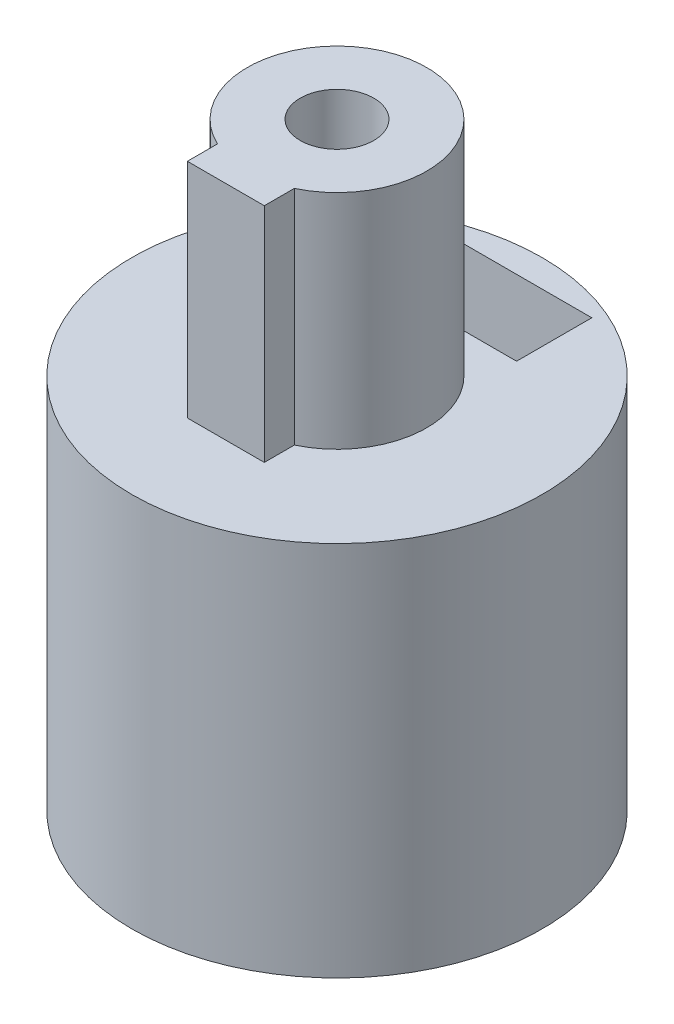
ISO-10303-21;
HEADER;
FILE_DESCRIPTION(('STEP AP214'),'2;1');
FILE_NAME('part.step','',(''),(''),'','','');
FILE_SCHEMA(('AUTOMOTIVE_DESIGN { 1 0 10303 214 1 1 1 1 }'));
ENDSEC;
DATA;
#1=APPLICATION_CONTEXT('core data for automotive mechanical design processes');
#2=APPLICATION_PROTOCOL_DEFINITION('international standard','automotive_design',2000,#1);
#3=PRODUCT_CONTEXT('',#1,'mechanical');
#4=PRODUCT('Part','Part','',(#3));
#5=PRODUCT_RELATED_PRODUCT_CATEGORY('part','',(#4));
#6=PRODUCT_DEFINITION_FORMATION('','',#4);
#7=PRODUCT_DEFINITION_CONTEXT('part definition',#1,'design');
#8=PRODUCT_DEFINITION('design','',#6,#7);
#9=PRODUCT_DEFINITION_SHAPE('','',#8);
#10=(LENGTH_UNIT() NAMED_UNIT(*) SI_UNIT(.MILLI.,.METRE.));
#11=(NAMED_UNIT(*) PLANE_ANGLE_UNIT() SI_UNIT($,.RADIAN.));
#12=(NAMED_UNIT(*) SI_UNIT($,.STERADIAN.) SOLID_ANGLE_UNIT());
#13=UNCERTAINTY_MEASURE_WITH_UNIT(LENGTH_MEASURE(1.E-05),#10,'distance_accuracy_value','');
#14=(GEOMETRIC_REPRESENTATION_CONTEXT(3) GLOBAL_UNCERTAINTY_ASSIGNED_CONTEXT((#13)) GLOBAL_UNIT_ASSIGNED_CONTEXT((#10,
#11,#12)) REPRESENTATION_CONTEXT('',''));
#15=CARTESIAN_POINT('',(0.,0.,0.));
#16=DIRECTION('',(0.,0.,1.));
#17=DIRECTION('',(1.,0.,0.));
#18=AXIS2_PLACEMENT_3D('',#15,#16,#17);
#19=CARTESIAN_POINT('',(0.,7.,-6.));
#20=DIRECTION('',(0.,0.,1.));
#21=DIRECTION('',(1.,0.,0.));
#22=AXIS2_PLACEMENT_3D('',#19,#20,#21);
#23=CYLINDRICAL_SURFACE('',#22,1.025);
#24=CARTESIAN_POINT('',(0.,8.025,-6.));
#25=CARTESIAN_POINT('',(-0.057129021805909,8.02499772840721,-5.99999900775209));
#26=CARTESIAN_POINT('',(-0.114288694426547,8.02020768113553,-5.99917558388442));
#27=CARTESIAN_POINT('',(-0.227003440677618,8.00118285182644,-5.99597008814761));
#28=CARTESIAN_POINT('',(-0.282557014382194,7.98693952098703,-5.99358660551168));
#29=CARTESIAN_POINT('',(-0.390412628331851,7.94945193314389,-5.98752819489086));
#30=CARTESIAN_POINT('',(-0.442717339459975,7.92621518637663,-5.98385434470439));
#31=CARTESIAN_POINT('',(-0.542679246717537,7.87142036283948,-5.97561861890346));
#32=CARTESIAN_POINT('',(-0.590336943676343,7.83986318416035,-5.97105683914425));
#33=CARTESIAN_POINT('',(-0.680135984205956,7.76898696325142,-5.96149941501592));
#34=CARTESIAN_POINT('',(-0.72222399560624,7.7296008182684,-5.95650024504773));
#35=CARTESIAN_POINT('',(-0.799228119899926,7.64432911453603,-5.94665830480908));
#36=CARTESIAN_POINT('',(-0.83414376866182,7.59844313549965,-5.94181554467714));
#37=CARTESIAN_POINT('',(-0.896027332048902,7.50110590633471,-5.93280057753614));
#38=CARTESIAN_POINT('',(-0.922942217268116,7.44962048335678,-5.92863292447034));
#39=CARTESIAN_POINT('',(-0.967721056978088,7.34277612409713,-5.92148911657744));
#40=CARTESIAN_POINT('',(-0.985585654718975,7.28741746342458,-5.91851287707366));
#41=CARTESIAN_POINT('',(-1.01158816944722,7.17496444613127,-5.91412405211724));
#42=CARTESIAN_POINT('',(-1.01981834503951,7.11789201196871,-5.91269664496829));
#43=CARTESIAN_POINT('',(-1.0266045006465,7.0031597815974,-5.91152229524133));
#44=CARTESIAN_POINT('',(-1.02516119995253,6.94550002937824,-5.91177522771819));
#45=CARTESIAN_POINT('',(-1.01271645572348,6.8318903608326,-5.91391945370944));
#46=CARTESIAN_POINT('',(-1.00181889187027,6.77592868044925,-5.91579294055823));
#47=CARTESIAN_POINT('',(-0.97093809525837,6.66663982621608,-5.92093928903694));
#48=CARTESIAN_POINT('',(-0.950954536531984,6.61331274696089,-5.92421220087215));
#49=CARTESIAN_POINT('',(-0.902364407216009,6.51049721851305,-5.9318077416241));
#50=CARTESIAN_POINT('',(-0.873714928690603,6.46102944752354,-5.93613557261378));
#51=CARTESIAN_POINT('',(-0.808636654316059,6.36756406826496,-5.94534973658277));
#52=CARTESIAN_POINT('',(-0.772207199569996,6.32356692381048,-5.95023611685009));
#53=CARTESIAN_POINT('',(-0.692038211440464,6.2416906191643,-5.96009492603012));
#54=CARTESIAN_POINT('',(-0.648209602257906,6.20389865817463,-5.96506764647446));
#55=CARTESIAN_POINT('',(-0.554787084587539,6.13619201555492,-5.97448004062525));
#56=CARTESIAN_POINT('',(-0.505193135382295,6.10627738956306,-5.9789197105666));
#57=CARTESIAN_POINT('',(-0.401564028575202,6.0551657177481,-5.9867725569888));
#58=CARTESIAN_POINT('',(-0.347524867685225,6.03397663545585,-5.99018479500469));
#59=CARTESIAN_POINT('',(-0.236583435115325,6.00099983015074,-5.99559083662011));
#60=CARTESIAN_POINT('',(-0.179681415700386,5.98921128033321,-5.9975847649625));
#61=CARTESIAN_POINT('',(-0.0653808172994131,5.9754889858301,-5.99991268288137));
#62=CARTESIAN_POINT('',(-0.00799700058598737,5.97343557927924,-6.00026682699029));
#63=CARTESIAN_POINT('',(0.106294577579118,5.97892246315691,-5.99933056568816));
#64=CARTESIAN_POINT('',(0.163202358214688,5.98646236508936,-5.99804022687302));
#65=CARTESIAN_POINT('',(0.274554949336557,6.01082231149179,-5.99397247481089));
#66=CARTESIAN_POINT('',(0.329013153116637,6.02758286365461,-5.99120459810796));
#67=CARTESIAN_POINT('',(0.434346698407185,6.06984473637203,-5.98449086136286));
#68=CARTESIAN_POINT('',(0.485221830138069,6.0953465681939,-5.98054493241952));
#69=CARTESIAN_POINT('',(0.58246311617523,6.15463939446082,-5.97186273771382));
#70=CARTESIAN_POINT('',(0.628783248246283,6.18850482598886,-5.96711950406798));
#71=CARTESIAN_POINT('',(0.715125836783952,6.26346146273558,-5.95738922262263));
#72=CARTESIAN_POINT('',(0.75514781070517,6.30455322110284,-5.95240215617974));
#73=CARTESIAN_POINT('',(0.828203708504393,6.39333374744174,-5.94268078613609));
#74=CARTESIAN_POINT('',(0.861156622624258,6.44108960234961,-5.93794983407302));
#75=CARTESIAN_POINT('',(0.918572497304516,6.54152931875124,-5.92933984229211));
#76=CARTESIAN_POINT('',(0.943035736678586,6.59421301833501,-5.92546077459866));
#77=CARTESIAN_POINT('',(0.982657874256186,6.70279040866835,-5.91901912534323));
#78=CARTESIAN_POINT('',(0.997856483411739,6.75866926003878,-5.91645093279999));
#79=CARTESIAN_POINT('',(1.01864245502096,6.87223450397019,-5.91290796951349));
#80=CARTESIAN_POINT('',(1.02423069968971,6.92992073012217,-5.91193305251065));
#81=CARTESIAN_POINT('',(1.02561176041543,7.04465383263375,-5.91169354428849));
#82=CARTESIAN_POINT('',(1.02153213625353,7.10169916696336,-5.91240668041866));
#83=CARTESIAN_POINT('',(1.00396974898029,7.21427885903823,-5.91541400302865));
#84=CARTESIAN_POINT('',(0.990487020878765,7.26981322240838,-5.91770818362188));
#85=CARTESIAN_POINT('',(0.954550985092882,7.37774153170815,-5.92361045759366));
#86=CARTESIAN_POINT('',(0.932109203860775,7.4301394137159,-5.92721686217777));
#87=CARTESIAN_POINT('',(0.878905351085741,7.53044701229056,-5.9353387767073));
#88=CARTESIAN_POINT('',(0.848142832774205,7.57835648767366,-5.93985433546496));
#89=CARTESIAN_POINT('',(0.778717727996033,7.66897074088246,-5.94935610169176));
#90=CARTESIAN_POINT('',(0.739961482891463,7.71160323040603,-5.95434747238202));
#91=CARTESIAN_POINT('',(0.655846210332251,7.78980307156242,-5.96419777785053));
#92=CARTESIAN_POINT('',(0.610485663211634,7.82536879264853,-5.96905668184154));
#93=CARTESIAN_POINT('',(0.514055463609574,7.88866371595542,-5.9781357643754));
#94=CARTESIAN_POINT('',(0.462946585113283,7.91633387123849,-5.98235102595813));
#95=CARTESIAN_POINT('',(0.356753960873555,7.9626528304007,-5.98962003307112));
#96=CARTESIAN_POINT('',(0.301674193065421,7.98131052229395,-5.99267492231261));
#97=CARTESIAN_POINT('',(0.205324889668461,8.00507473985857,-5.99662063052046));
#98=CARTESIAN_POINT('',(0.164634720196102,8.01253459518788,-5.99788104819846));
#99=CARTESIAN_POINT('',(0.0826350389649352,8.02249800067083,-5.99957108407766));
#100=CARTESIAN_POINT('',(0.0413255387647287,8.02500164320678,-6.00000071776442));
#101=CARTESIAN_POINT('',(0.,8.025,-6.));
#102=B_SPLINE_CURVE_WITH_KNOTS('',3,(#24,#25,#26,#27,#28,#29,#30,#31,#32,#33,#34,#35,#36,#37,
#38,#39,#40,#41,#42,#43,#44,#45,#46,#47,#48,#49,#50,#51,#52,#53,#54,#55,#56,#57,#58,#59,#60,#61,
#62,#63,#64,#65,#66,#67,#68,#69,#70,#71,#72,#73,#74,#75,#76,#77,#78,#79,#80,#81,#82,#83,#84,#85,
#86,#87,#88,#89,#90,#91,#92,#93,#94,#95,#96,#97,#98,#99,#100,#101),.UNSPECIFIED.,.T.,.F.,(4,2,2,
2,2,2,2,2,2,2,2,2,2,2,2,2,2,2,2,2,2,2,2,2,2,2,2,2,2,2,2,2,2,2,2,2,2,2,4),(0.,0.171235994893447,
0.342627053456379,0.513875294237687,0.685105058388228,0.857871180813246,1.03064847960544,
1.20454664979448,1.37843245841822,1.55063916189725,1.72283306073277,1.89315858532088,
2.06349022096238,2.23467942944234,2.40588314192621,2.57931792140326,2.75275392582942,
2.92634787091466,3.0999265462136,3.27136600700557,3.44279852530835,3.61313770472599,
3.78348684878489,3.95541050932786,4.12734733572354,4.30116013270972,4.4749672208821,
4.64802398347102,4.821064858896,4.99183533604723,5.16260517738581,5.33315601574305,
5.50371601337198,5.67640118185052,5.84912614859001,6.02311087172201,6.19692366051839,
6.32079330552967,6.44466064162599),.UNSPECIFIED.);
#103=CARTESIAN_POINT('',(0.,8.025,-6.));
#104=VERTEX_POINT('',#103);
#105=EDGE_CURVE('E252',#104,#104,#102,.T.);
#106=ORIENTED_EDGE('',*,*,#105,.F.);
#107=EDGE_LOOP('',(#106));
#108=FACE_BOUND('',#107,.T.);
#109=CARTESIAN_POINT('',(0.,7.,-5.2));
#110=DIRECTION('',(0.,0.,1.));
#111=DIRECTION('',(1.,0.,0.));
#112=AXIS2_PLACEMENT_3D('',#109,#110,#111);
#113=CIRCLE('',#112,1.025);
#114=CARTESIAN_POINT('',(1.025,7.,-5.2));
#115=VERTEX_POINT('',#114);
#116=EDGE_CURVE('E187',#115,#115,#113,.F.);
#117=ORIENTED_EDGE('',*,*,#116,.F.);
#118=EDGE_LOOP('',(#117));
#119=FACE_BOUND('',#118,.T.);
#120=ADVANCED_FACE('F50',(#108,#119),#23,.F.);
#121=CARTESIAN_POINT('',(0.,11.,0.));
#122=DIRECTION('',(0.,1.,0.));
#123=DIRECTION('',(0.,0.,1.));
#124=AXIS2_PLACEMENT_3D('',#121,#122,#123);
#125=PLANE('',#124);
#126=DIRECTION('',(0.,0.,1.));
#127=VECTOR('',#126,1.);
#128=CARTESIAN_POINT('',(-1.125,11.,0.));
#129=LINE('',#128,#127);
#130=CARTESIAN_POINT('',(-1.125,11.,2.37170824512628));
#131=VERTEX_POINT('',#130);
#132=CARTESIAN_POINT('',(-1.125,11.,3.25));
#133=VERTEX_POINT('',#132);
#134=EDGE_CURVE('E74',#131,#133,#129,.T.);
#135=ORIENTED_EDGE('',*,*,#134,.F.);
#136=CARTESIAN_POINT('',(0.,11.,0.));
#137=DIRECTION('',(0.,1.,0.));
#138=DIRECTION('',(0.,0.,1.));
#139=AXIS2_PLACEMENT_3D('',#136,#137,#138);
#140=CIRCLE('',#139,2.625);
#141=CARTESIAN_POINT('',(1.125,11.,2.37170824512628));
#142=VERTEX_POINT('',#141);
#143=EDGE_CURVE('E194',#142,#131,#140,.T.);
#144=ORIENTED_EDGE('',*,*,#143,.F.);
#145=DIRECTION('',(0.,0.,1.));
#146=VECTOR('',#145,1.);
#147=CARTESIAN_POINT('',(1.125,11.,0.));
#148=LINE('',#147,#146);
#149=CARTESIAN_POINT('',(1.125,11.,3.25));
#150=VERTEX_POINT('',#149);
#151=EDGE_CURVE('E200',#142,#150,#148,.T.);
#152=ORIENTED_EDGE('',*,*,#151,.T.);
#153=DIRECTION('',(1.,0.,0.));
#154=VECTOR('',#153,1.);
#155=CARTESIAN_POINT('',(0.,11.,3.25));
#156=LINE('',#155,#154);
#157=EDGE_CURVE('E207',#133,#150,#156,.T.);
#158=ORIENTED_EDGE('',*,*,#157,.F.);
#159=EDGE_LOOP('',(#135,#144,#152,#158));
#160=FACE_BOUND('',#159,.T.);
#161=CARTESIAN_POINT('',(0.,11.,0.));
#162=DIRECTION('',(0.,1.,0.));
#163=DIRECTION('',(0.,0.,1.));
#164=AXIS2_PLACEMENT_3D('',#161,#162,#163);
#165=CIRCLE('',#164,6.);
#166=CARTESIAN_POINT('',(0.,11.,6.));
#167=VERTEX_POINT('',#166);
#168=EDGE_CURVE('E222',#167,#167,#165,.T.);
#169=ORIENTED_EDGE('',*,*,#168,.T.);
#170=EDGE_LOOP('',(#169));
#171=FACE_BOUND('',#170,.T.);
#172=DIRECTION('',(0.,0.,-1.));
#173=VECTOR('',#172,1.);
#174=CARTESIAN_POINT('',(-2.25,11.,0.));
#175=LINE('',#174,#173);
#176=CARTESIAN_POINT('',(-2.25,11.,-3.));
#177=VERTEX_POINT('',#176);
#178=CARTESIAN_POINT('',(-2.25,11.,-5.2));
#179=VERTEX_POINT('',#178);
#180=EDGE_CURVE('E370',#177,#179,#175,.T.);
#181=ORIENTED_EDGE('',*,*,#180,.T.);
#182=DIRECTION('',(1.,0.,0.));
#183=VECTOR('',#182,1.);
#184=CARTESIAN_POINT('',(0.,11.,-5.2));
#185=LINE('',#184,#183);
#186=CARTESIAN_POINT('',(2.25,11.,-5.2));
#187=VERTEX_POINT('',#186);
#188=EDGE_CURVE('E12',#179,#187,#185,.T.);
#189=ORIENTED_EDGE('',*,*,#188,.T.);
#190=DIRECTION('',(0.,0.,-1.));
#191=VECTOR('',#190,1.);
#192=CARTESIAN_POINT('',(2.25,11.,0.));
#193=LINE('',#192,#191);
#194=CARTESIAN_POINT('',(2.25,11.,-3.));
#195=VERTEX_POINT('',#194);
#196=EDGE_CURVE('E59',#195,#187,#193,.T.);
#197=ORIENTED_EDGE('',*,*,#196,.F.);
#198=DIRECTION('',(1.,0.,0.));
#199=VECTOR('',#198,1.);
#200=CARTESIAN_POINT('',(0.,11.,-3.));
#201=LINE('',#200,#199);
#202=EDGE_CURVE('E367',#177,#195,#201,.T.);
#203=ORIENTED_EDGE('',*,*,#202,.F.);
#204=EDGE_LOOP('',(#181,#189,#197,#203));
#205=FACE_BOUND('',#204,.T.);
#206=ADVANCED_FACE('F266',(#160,#171,#205),#125,.T.);
#207=CARTESIAN_POINT('',(0.,7.,-3.));
#208=DIRECTION('',(0.,0.,1.));
#209=DIRECTION('',(1.,0.,0.));
#210=AXIS2_PLACEMENT_3D('',#207,#208,#209);
#211=CIRCLE('',#210,1.025);
#212=CARTESIAN_POINT('',(1.025,7.,-3.));
#213=VERTEX_POINT('',#212);
#214=EDGE_CURVE('E183',#213,#213,#211,.F.);
#215=ORIENTED_EDGE('',*,*,#214,.T.);
#216=EDGE_LOOP('',(#215));
#217=FACE_BOUND('',#216,.T.);
#218=CARTESIAN_POINT('',(1.025,7.,-2.03100960115899));
#219=CARTESIAN_POINT('',(1.02499305854172,6.94580313512061,-2.03101675073342));
#220=CARTESIAN_POINT('',(1.0206745216515,6.89153881445941,-2.03321085651534));
#221=CARTESIAN_POINT('',(1.00358270082772,6.78460510485403,-2.0416980581248));
#222=CARTESIAN_POINT('',(0.990788348038326,6.73194003331455,-2.04800136782916));
#223=CARTESIAN_POINT('',(0.957371317061422,6.62995810816608,-2.06383203727762));
#224=CARTESIAN_POINT('',(0.936784232790857,6.58062721520536,-2.07334471681006));
#225=CARTESIAN_POINT('',(0.888471962864818,6.4861312192677,-2.09450122881857));
#226=CARTESIAN_POINT('',(0.860747633677805,6.44096561733903,-2.10614480553883));
#227=CARTESIAN_POINT('',(0.79678489522161,6.35275992113629,-2.13119993915256));
#228=CARTESIAN_POINT('',(0.760103742802286,6.31005949541495,-2.14467753746116));
#229=CARTESIAN_POINT('',(0.680194851473417,6.2311602056761,-2.17134377375254));
#230=CARTESIAN_POINT('',(0.636964341178101,6.19496410823237,-2.18453228669049));
#231=CARTESIAN_POINT('',(0.542415872381946,6.12826198588399,-2.20996064454976));
#232=CARTESIAN_POINT('',(0.490793409538977,6.09815197124655,-2.22211494401467));
#233=CARTESIAN_POINT('',(0.382567541059317,6.04719424567454,-2.24327872932343));
#234=CARTESIAN_POINT('',(0.325966720901682,6.0263417605334,-2.25228983563042));
#235=CARTESIAN_POINT('',(0.212970160353229,5.99576542371113,-2.2656808654623));
#236=CARTESIAN_POINT('',(0.156763485533799,5.9854520689123,-2.27030492531737));
#237=CARTESIAN_POINT('',(0.043240508040524,5.97432774538073,-2.27529716989795));
#238=CARTESIAN_POINT('',(-0.0140752492633984,5.97351221952244,-2.27566739564204));
#239=CARTESIAN_POINT('',(-0.123847971148628,5.98112887118864,-2.27224340298251));
#240=CARTESIAN_POINT('',(-0.176361175027903,5.98890911280686,-2.2687427506709));
#241=CARTESIAN_POINT('',(-0.279242942211879,6.01236006777681,-2.25838933142482));
#242=CARTESIAN_POINT('',(-0.329611346263537,6.02803136594145,-2.25153631604495));
#243=CARTESIAN_POINT('',(-0.427706522368059,6.06698298482842,-2.23499578386926));
#244=CARTESIAN_POINT('',(-0.475381576207556,6.09037521939458,-2.22526681111408));
#245=CARTESIAN_POINT('',(-0.566254499416457,6.14398203989515,-2.20389725092487));
#246=CARTESIAN_POINT('',(-0.609450722901074,6.17419912095697,-2.19225596478481));
#247=CARTESIAN_POINT('',(-0.693835195075624,6.24340915806827,-2.16709690146209));
#248=CARTESIAN_POINT('',(-0.734583025971103,6.28291225671997,-2.15350350567298));
#249=CARTESIAN_POINT('',(-0.809085732219168,6.36816714997075,-2.126635133506));
#250=CARTESIAN_POINT('',(-0.842836938397015,6.41392220246189,-2.11336032741341));
#251=CARTESIAN_POINT('',(-0.903802401086256,6.51287836214923,-2.0880386327353));
#252=CARTESIAN_POINT('',(-0.930665742288698,6.56631777288793,-2.07607095538925));
#253=CARTESIAN_POINT('',(-0.974826328610418,6.67763991383049,-2.05570831786357));
#254=CARTESIAN_POINT('',(-0.992131734683376,6.73551880517841,-2.04731031117017));
#255=CARTESIAN_POINT('',(-1.0154630655215,6.84965350472586,-2.03583354808297));
#256=CARTESIAN_POINT('',(-1.02221041961624,6.90572687993263,-2.03241580026853));
#257=CARTESIAN_POINT('',(-1.02638119884195,7.0182969134742,-2.03031387061239));
#258=CARTESIAN_POINT('',(-1.02380888216569,7.07479336673074,-2.03162752697264));
#259=CARTESIAN_POINT('',(-1.01007402176836,7.18179961890066,-2.03848570526479));
#260=CARTESIAN_POINT('',(-0.99961848657219,7.23242563679536,-2.04368170889992));
#261=CARTESIAN_POINT('',(-0.971393817762267,7.33114378830243,-2.05724629557003));
#262=CARTESIAN_POINT('',(-0.953622767652154,7.37923525419363,-2.06561570992013));
#263=CARTESIAN_POINT('',(-0.910395547565492,7.47395939716699,-2.08503924704702));
#264=CARTESIAN_POINT('',(-0.88462860096463,7.52042815517491,-2.09619752956149));
#265=CARTESIAN_POINT('',(-0.826433470484225,7.6086274635146,-2.11981558555304));
#266=CARTESIAN_POINT('',(-0.79400210536826,7.65035573616607,-2.13227597918699));
#267=CARTESIAN_POINT('',(-0.719658934276617,7.73216252943475,-2.15856814949906));
#268=CARTESIAN_POINT('',(-0.677129022943646,7.77167706138903,-2.17241448251377));
#269=CARTESIAN_POINT('',(-0.585751814775504,7.84313933363801,-2.19881326144406));
#270=CARTESIAN_POINT('',(-0.536903516229462,7.87508587183166,-2.21136550162719));
#271=CARTESIAN_POINT('',(-0.433474278154647,7.9307012785944,-2.2339541877216));
#272=CARTESIAN_POINT('',(-0.378840403120888,7.95428324839878,-2.24396393265898));
#273=CARTESIAN_POINT('',(-0.265806206029625,7.99172054341969,-2.26013761627986));
#274=CARTESIAN_POINT('',(-0.207408578430705,8.00558274435937,-2.26630427320341));
#275=CARTESIAN_POINT('',(-0.0934994357482063,8.02221818282079,-2.27373713364949));
#276=CARTESIAN_POINT('',(-0.0381257304856162,8.02578282911106,-2.27535282280401));
#277=CARTESIAN_POINT('',(0.0724331972271812,8.02393007728227,-2.27451783458672));
#278=CARTESIAN_POINT('',(0.127618460568221,8.01851477071075,-2.27206810410378));
#279=CARTESIAN_POINT('',(0.233563720754763,7.99941826001622,-2.2635744463055));
#280=CARTESIAN_POINT('',(0.28441017258005,7.9861330744793,-2.25770292214697));
#281=CARTESIAN_POINT('',(0.383109362169428,7.95214391069704,-2.24306564239969));
#282=CARTESIAN_POINT('',(0.43096158351782,7.93143865683051,-2.2342993891839));
#283=CARTESIAN_POINT('',(0.524743440665279,7.88215821308596,-2.2141984063482));
#284=CARTESIAN_POINT('',(0.570484681080244,7.85326604619103,-2.20276443896718));
#285=CARTESIAN_POINT('',(0.656670899186577,7.78886342010433,-2.17862679955754));
#286=CARTESIAN_POINT('',(0.697113576659864,7.753350102635,-2.16592258027768));
#287=CARTESIAN_POINT('',(0.774987034949135,7.67333790377692,-2.13935674897724));
#288=CARTESIAN_POINT('',(0.811907194003984,7.62834375148744,-2.12548486442027));
#289=CARTESIAN_POINT('',(0.877792222188162,7.5324386924507,-2.09913534197608));
#290=CARTESIAN_POINT('',(0.906751961960767,7.48152400068186,-2.08665860612023));
#291=CARTESIAN_POINT('',(0.955913374636466,7.37461733338414,-2.06460360075242));
#292=CARTESIAN_POINT('',(0.976058937979338,7.31859549667245,-2.05504401454339));
#293=CARTESIAN_POINT('',(1.00635035824895,7.20347108886105,-2.04038676910276));
#294=CARTESIAN_POINT('',(1.01652977725509,7.14437956828245,-2.03527414079194));
#295=CARTESIAN_POINT('',(1.02382967048922,7.05662914372933,-2.03159943073811));
#296=CARTESIAN_POINT('',(1.0250036276704,7.02832378364115,-2.03100586472516));
#297=CARTESIAN_POINT('',(1.025,7.,-2.03100960115899));
#298=B_SPLINE_CURVE_WITH_KNOTS('',3,(#218,#219,#220,#221,#222,#223,#224,#225,#226,#227,#228,
#229,#230,#231,#232,#233,#234,#235,#236,#237,#238,#239,#240,#241,#242,#243,#244,#245,#246,#247,
#248,#249,#250,#251,#252,#253,#254,#255,#256,#257,#258,#259,#260,#261,#262,#263,#264,#265,#266,
#267,#268,#269,#270,#271,#272,#273,#274,#275,#276,#277,#278,#279,#280,#281,#282,#283,#284,#285,
#286,#287,#288,#289,#290,#291,#292,#293,#294,#295,#296,#297),.UNSPECIFIED.,.T.,.F.,(4,2,2,2,2,2,
2,2,2,2,2,2,2,2,2,2,2,2,2,2,2,2,2,2,2,2,2,2,2,2,2,2,2,2,2,2,2,2,2,4),(0.,0.162499187532077,
0.325403832599262,0.487573204930667,0.649723126022222,0.822627850801423,0.995605946296104,
1.17762007217048,1.35954022207227,1.53061144916441,1.70160059168741,1.86045961560494,
2.01933041443293,2.18061331868081,2.34195528281562,2.51626462323901,2.69066514511915,
2.872701603609,3.05458239072871,3.22338808387001,3.39211665878125,3.54728458339283,
3.70249318432178,3.86470996788299,4.02700436567437,4.20522926833185,4.38348246130159,
4.56353671939287,4.7434634790163,4.90913770320831,5.07477334514354,5.23270796660228,
5.39066975242973,5.55586529202839,5.72113231053275,5.89980864660713,6.07859984568211,
6.25851320224537,6.43781857528333,6.52274215600636),.UNSPECIFIED.);
#299=CARTESIAN_POINT('',(1.025,7.,-2.03100960115899));
#300=VERTEX_POINT('',#299);
#301=EDGE_CURVE('E245',#300,#300,#298,.T.);
#302=ORIENTED_EDGE('',*,*,#301,.F.);
#303=EDGE_LOOP('',(#302));
#304=FACE_BOUND('',#303,.T.);
#305=ADVANCED_FACE('F263',(#217,#304),#23,.F.);
#306=CARTESIAN_POINT('',(0.,10.,0.));
#307=DIRECTION('',(0.,-1.,0.));
#308=DIRECTION('',(0.,0.,-1.));
#309=AXIS2_PLACEMENT_3D('',#306,#307,#308);
#310=CYLINDRICAL_SURFACE('',#309,6.);
#311=ORIENTED_EDGE('',*,*,#105,.T.);
#312=EDGE_LOOP('',(#311));
#313=FACE_BOUND('',#312,.T.);
#314=CARTESIAN_POINT('',(0.,0.,0.));
#315=DIRECTION('',(0.,1.,0.));
#316=DIRECTION('',(0.,0.,1.));
#317=AXIS2_PLACEMENT_3D('',#314,#315,#316);
#318=CIRCLE('',#317,6.);
#319=CARTESIAN_POINT('',(0.,0.,6.));
#320=VERTEX_POINT('',#319);
#321=EDGE_CURVE('E249',#320,#320,#318,.T.);
#322=ORIENTED_EDGE('',*,*,#321,.T.);
#323=EDGE_LOOP('',(#322));
#324=FACE_BOUND('',#323,.T.);
#325=ORIENTED_EDGE('',*,*,#168,.F.);
#326=EDGE_LOOP('',(#325));
#327=FACE_BOUND('',#326,.T.);
#328=ADVANCED_FACE('F52',(#313,#324,#327),#310,.T.);
#329=CARTESIAN_POINT('',(0.,0.,0.));
#330=DIRECTION('',(0.,1.,0.));
#331=DIRECTION('',(0.,0.,1.));
#332=AXIS2_PLACEMENT_3D('',#329,#330,#331);
#333=PLANE('',#332);
#334=CARTESIAN_POINT('',(0.,0.,0.));
#335=DIRECTION('',(0.,1.,0.));
#336=DIRECTION('',(0.,0.,1.));
#337=AXIS2_PLACEMENT_3D('',#334,#335,#336);
#338=CIRCLE('',#337,2.275);
#339=CARTESIAN_POINT('',(0.,0.,2.275));
#340=VERTEX_POINT('',#339);
#341=EDGE_CURVE('E237',#340,#340,#338,.T.);
#342=ORIENTED_EDGE('',*,*,#341,.T.);
#343=EDGE_LOOP('',(#342));
#344=FACE_BOUND('',#343,.T.);
#345=ORIENTED_EDGE('',*,*,#321,.F.);
#346=EDGE_LOOP('',(#345));
#347=FACE_BOUND('',#346,.T.);
#348=ADVANCED_FACE('F271',(#344,#347),#333,.F.);
#349=CARTESIAN_POINT('',(0.,10.,0.));
#350=DIRECTION('',(0.,-1.,0.));
#351=DIRECTION('',(0.,0.,-1.));
#352=AXIS2_PLACEMENT_3D('',#349,#350,#351);
#353=CYLINDRICAL_SURFACE('',#352,2.275);
#354=DIRECTION('',(0.,-1.,0.));
#355=VECTOR('',#354,1.);
#356=CARTESIAN_POINT('',(0.475,10.,2.2248595461287));
#357=LINE('',#356,#355);
#358=CARTESIAN_POINT('',(0.475,10.,2.2248595461287));
#359=VERTEX_POINT('',#358);
#360=CARTESIAN_POINT('',(0.475,8.8,2.2248595461287));
#361=VERTEX_POINT('',#360);
#362=EDGE_CURVE('E359',#359,#361,#357,.T.);
#363=ORIENTED_EDGE('',*,*,#362,.F.);
#364=CARTESIAN_POINT('',(0.,10.,0.));
#365=DIRECTION('',(0.,1.,0.));
#366=DIRECTION('',(0.,0.,1.));
#367=AXIS2_PLACEMENT_3D('',#364,#365,#366);
#368=CIRCLE('',#367,2.275);
#369=CARTESIAN_POINT('',(0.475,10.,-2.2248595461287));
#370=VERTEX_POINT('',#369);
#371=EDGE_CURVE('E242',#359,#370,#368,.T.);
#372=ORIENTED_EDGE('',*,*,#371,.T.);
#373=DIRECTION('',(0.,-1.,0.));
#374=VECTOR('',#373,1.);
#375=CARTESIAN_POINT('',(0.475,10.,-2.2248595461287));
#376=LINE('',#375,#374);
#377=CARTESIAN_POINT('',(0.475,8.8,-2.2248595461287));
#378=VERTEX_POINT('',#377);
#379=EDGE_CURVE('E361',#378,#370,#376,.F.);
#380=ORIENTED_EDGE('',*,*,#379,.F.);
#381=CARTESIAN_POINT('',(0.,8.8,0.));
#382=DIRECTION('',(0.,-1.,0.));
#383=DIRECTION('',(0.,0.,-1.));
#384=AXIS2_PLACEMENT_3D('',#381,#382,#383);
#385=CIRCLE('',#384,2.275);
#386=CARTESIAN_POINT('',(-0.475,8.8,-2.2248595461287));
#387=VERTEX_POINT('',#386);
#388=EDGE_CURVE('E258',#387,#378,#385,.T.);
#389=ORIENTED_EDGE('',*,*,#388,.F.);
#390=DIRECTION('',(0.,-1.,0.));
#391=VECTOR('',#390,1.);
#392=CARTESIAN_POINT('',(-0.475,10.,-2.2248595461287));
#393=LINE('',#392,#391);
#394=CARTESIAN_POINT('',(-0.475,10.,-2.2248595461287));
#395=VERTEX_POINT('',#394);
#396=EDGE_CURVE('E388',#395,#387,#393,.T.);
#397=ORIENTED_EDGE('',*,*,#396,.F.);
#398=CARTESIAN_POINT('',(-0.475,10.,2.2248595461287));
#399=VERTEX_POINT('',#398);
#400=EDGE_CURVE('E246',#395,#399,#368,.T.);
#401=ORIENTED_EDGE('',*,*,#400,.T.);
#402=DIRECTION('',(0.,-1.,0.));
#403=VECTOR('',#402,1.);
#404=CARTESIAN_POINT('',(-0.475,10.,2.2248595461287));
#405=LINE('',#404,#403);
#406=CARTESIAN_POINT('',(-0.475,8.8,2.2248595461287));
#407=VERTEX_POINT('',#406);
#408=EDGE_CURVE('E368',#407,#399,#405,.F.);
#409=ORIENTED_EDGE('',*,*,#408,.F.);
#410=EDGE_CURVE('E366',#361,#407,#385,.T.);
#411=ORIENTED_EDGE('',*,*,#410,.F.);
#412=EDGE_LOOP('',(#363,#372,#380,#389,#397,#401,#409,#411));
#413=FACE_BOUND('',#412,.T.);
#414=ORIENTED_EDGE('',*,*,#341,.F.);
#415=EDGE_LOOP('',(#414));
#416=FACE_BOUND('',#415,.T.);
#417=ORIENTED_EDGE('',*,*,#301,.T.);
#418=EDGE_LOOP('',(#417));
#419=FACE_BOUND('',#418,.T.);
#420=ADVANCED_FACE('F268',(#413,#416,#419),#353,.F.);
#421=CARTESIAN_POINT('',(0.,8.8,0.));
#422=DIRECTION('',(0.,-1.,0.));
#423=DIRECTION('',(0.,0.,-1.));
#424=AXIS2_PLACEMENT_3D('',#421,#422,#423);
#425=PLANE('',#424);
#426=DIRECTION('',(0.,0.,-1.));
#427=VECTOR('',#426,1.);
#428=CARTESIAN_POINT('',(0.475,8.8,3.53457335348961));
#429=LINE('',#428,#427);
#430=EDGE_CURVE('E230',#361,#378,#429,.T.);
#431=ORIENTED_EDGE('',*,*,#430,.F.);
#432=ORIENTED_EDGE('',*,*,#410,.T.);
#433=DIRECTION('',(0.,0.,1.));
#434=VECTOR('',#433,1.);
#435=CARTESIAN_POINT('',(-0.475,8.8,3.53457335348961));
#436=LINE('',#435,#434);
#437=EDGE_CURVE('E233',#387,#407,#436,.T.);
#438=ORIENTED_EDGE('',*,*,#437,.F.);
#439=ORIENTED_EDGE('',*,*,#388,.T.);
#440=EDGE_LOOP('',(#431,#432,#438,#439));
#441=FACE_BOUND('',#440,.T.);
#442=ADVANCED_FACE('F279',(#441),#425,.T.);
#443=CARTESIAN_POINT('',(0.475,8.8,3.53457335348961));
#444=DIRECTION('',(1.,0.,0.));
#445=DIRECTION('',(0.,0.,-1.));
#446=AXIS2_PLACEMENT_3D('',#443,#444,#445);
#447=PLANE('',#446);
#448=DIRECTION('',(0.,0.,-1.));
#449=VECTOR('',#448,1.);
#450=CARTESIAN_POINT('',(0.475,10.,3.53457335348961));
#451=LINE('',#450,#449);
#452=EDGE_CURVE('E229',#359,#370,#451,.T.);
#453=ORIENTED_EDGE('',*,*,#452,.F.);
#454=ORIENTED_EDGE('',*,*,#362,.T.);
#455=ORIENTED_EDGE('',*,*,#430,.T.);
#456=ORIENTED_EDGE('',*,*,#379,.T.);
#457=EDGE_LOOP('',(#453,#454,#455,#456));
#458=FACE_BOUND('',#457,.T.);
#459=ADVANCED_FACE('F348',(#458),#447,.T.);
#460=CARTESIAN_POINT('',(-0.475,8.8,3.53457335348961));
#461=DIRECTION('',(-1.,0.,0.));
#462=DIRECTION('',(0.,0.,1.));
#463=AXIS2_PLACEMENT_3D('',#460,#461,#462);
#464=PLANE('',#463);
#465=DIRECTION('',(0.,0.,1.));
#466=VECTOR('',#465,1.);
#467=CARTESIAN_POINT('',(-0.475,10.,3.53457335348961));
#468=LINE('',#467,#466);
#469=EDGE_CURVE('E234',#395,#399,#468,.T.);
#470=ORIENTED_EDGE('',*,*,#469,.F.);
#471=ORIENTED_EDGE('',*,*,#396,.T.);
#472=ORIENTED_EDGE('',*,*,#437,.T.);
#473=ORIENTED_EDGE('',*,*,#408,.T.);
#474=EDGE_LOOP('',(#470,#471,#472,#473));
#475=FACE_BOUND('',#474,.T.);
#476=ADVANCED_FACE('F344',(#475),#464,.T.);
#477=CARTESIAN_POINT('',(0.,10.,0.));
#478=DIRECTION('',(0.,1.,0.));
#479=DIRECTION('',(0.,0.,1.));
#480=AXIS2_PLACEMENT_3D('',#477,#478,#479);
#481=PLANE('',#480);
#482=ORIENTED_EDGE('',*,*,#400,.F.);
#483=ORIENTED_EDGE('',*,*,#469,.T.);
#484=EDGE_LOOP('',(#482,#483));
#485=FACE_BOUND('',#484,.T.);
#486=ADVANCED_FACE('F341',(#485),#481,.F.);
#487=ORIENTED_EDGE('',*,*,#371,.F.);
#488=ORIENTED_EDGE('',*,*,#452,.T.);
#489=EDGE_LOOP('',(#487,#488));
#490=FACE_BOUND('',#489,.T.);
#491=ADVANCED_FACE('F336',(#490),#481,.F.);
#492=CARTESIAN_POINT('',(-1.125,17.5,0.));
#493=DIRECTION('',(1.,0.,0.));
#494=DIRECTION('',(0.,0.,-1.));
#495=AXIS2_PLACEMENT_3D('',#492,#493,#494);
#496=PLANE('',#495);
#497=ORIENTED_EDGE('',*,*,#134,.T.);
#498=DIRECTION('',(0.,-1.,0.));
#499=VECTOR('',#498,1.);
#500=CARTESIAN_POINT('',(-1.125,17.5,3.25));
#501=LINE('',#500,#499);
#502=CARTESIAN_POINT('',(-1.125,17.5,3.25));
#503=VERTEX_POINT('',#502);
#504=EDGE_CURVE('E217',#503,#133,#501,.T.);
#505=ORIENTED_EDGE('',*,*,#504,.F.);
#506=DIRECTION('',(0.,0.,1.));
#507=VECTOR('',#506,1.);
#508=CARTESIAN_POINT('',(-1.125,17.5,0.));
#509=LINE('',#508,#507);
#510=CARTESIAN_POINT('',(-1.125,17.5,2.37170824512628));
#511=VERTEX_POINT('',#510);
#512=EDGE_CURVE('E197',#511,#503,#509,.T.);
#513=ORIENTED_EDGE('',*,*,#512,.F.);
#514=DIRECTION('',(0.,-1.,0.));
#515=VECTOR('',#514,1.);
#516=CARTESIAN_POINT('',(-1.125,17.5,2.37170824512628));
#517=LINE('',#516,#515);
#518=EDGE_CURVE('E220',#511,#131,#517,.T.);
#519=ORIENTED_EDGE('',*,*,#518,.T.);
#520=EDGE_LOOP('',(#497,#505,#513,#519));
#521=FACE_BOUND('',#520,.T.);
#522=ADVANCED_FACE('F332',(#521),#496,.F.);
#523=CARTESIAN_POINT('',(0.,17.5,3.25));
#524=DIRECTION('',(0.,0.,-1.));
#525=DIRECTION('',(-1.,0.,0.));
#526=AXIS2_PLACEMENT_3D('',#523,#524,#525);
#527=PLANE('',#526);
#528=ORIENTED_EDGE('',*,*,#157,.T.);
#529=DIRECTION('',(0.,-1.,0.));
#530=VECTOR('',#529,1.);
#531=CARTESIAN_POINT('',(1.125,17.5,3.25));
#532=LINE('',#531,#530);
#533=CARTESIAN_POINT('',(1.125,17.5,3.25));
#534=VERTEX_POINT('',#533);
#535=EDGE_CURVE('E214',#534,#150,#532,.T.);
#536=ORIENTED_EDGE('',*,*,#535,.F.);
#537=DIRECTION('',(1.,0.,0.));
#538=VECTOR('',#537,1.);
#539=CARTESIAN_POINT('',(0.,17.5,3.25));
#540=LINE('',#539,#538);
#541=EDGE_CURVE('E199',#503,#534,#540,.T.);
#542=ORIENTED_EDGE('',*,*,#541,.F.);
#543=ORIENTED_EDGE('',*,*,#504,.T.);
#544=EDGE_LOOP('',(#528,#536,#542,#543));
#545=FACE_BOUND('',#544,.T.);
#546=ADVANCED_FACE('F328',(#545),#527,.F.);
#547=CARTESIAN_POINT('',(1.125,17.5,0.));
#548=DIRECTION('',(1.,0.,0.));
#549=DIRECTION('',(0.,0.,-1.));
#550=AXIS2_PLACEMENT_3D('',#547,#548,#549);
#551=PLANE('',#550);
#552=ORIENTED_EDGE('',*,*,#151,.F.);
#553=DIRECTION('',(0.,-1.,0.));
#554=VECTOR('',#553,1.);
#555=CARTESIAN_POINT('',(1.125,17.5,2.37170824512628));
#556=LINE('',#555,#554);
#557=CARTESIAN_POINT('',(1.125,17.5,2.37170824512628));
#558=VERTEX_POINT('',#557);
#559=EDGE_CURVE('E205',#558,#142,#556,.T.);
#560=ORIENTED_EDGE('',*,*,#559,.F.);
#561=DIRECTION('',(0.,0.,1.));
#562=VECTOR('',#561,1.);
#563=CARTESIAN_POINT('',(1.125,17.5,0.));
#564=LINE('',#563,#562);
#565=EDGE_CURVE('E202',#558,#534,#564,.T.);
#566=ORIENTED_EDGE('',*,*,#565,.T.);
#567=ORIENTED_EDGE('',*,*,#535,.T.);
#568=EDGE_LOOP('',(#552,#560,#566,#567));
#569=FACE_BOUND('',#568,.T.);
#570=ADVANCED_FACE('F324',(#569),#551,.T.);
#571=CARTESIAN_POINT('',(0.,17.5,0.));
#572=DIRECTION('',(0.,1.,0.));
#573=DIRECTION('',(0.,0.,1.));
#574=AXIS2_PLACEMENT_3D('',#571,#572,#573);
#575=PLANE('',#574);
#576=CARTESIAN_POINT('',(0.,17.5,0.));
#577=DIRECTION('',(0.,1.,0.));
#578=DIRECTION('',(0.,0.,1.));
#579=AXIS2_PLACEMENT_3D('',#576,#577,#578);
#580=CIRCLE('',#579,1.075);
#581=CARTESIAN_POINT('',(0.,17.5,1.075));
#582=VERTEX_POINT('',#581);
#583=EDGE_CURVE('E190',#582,#582,#580,.T.);
#584=ORIENTED_EDGE('',*,*,#583,.F.);
#585=EDGE_LOOP('',(#584));
#586=FACE_BOUND('',#585,.T.);
#587=ORIENTED_EDGE('',*,*,#565,.F.);
#588=CARTESIAN_POINT('',(0.,17.5,0.));
#589=DIRECTION('',(0.,1.,0.));
#590=DIRECTION('',(0.,0.,1.));
#591=AXIS2_PLACEMENT_3D('',#588,#589,#590);
#592=CIRCLE('',#591,2.625);
#593=EDGE_CURVE('E208',#558,#511,#592,.T.);
#594=ORIENTED_EDGE('',*,*,#593,.T.);
#595=ORIENTED_EDGE('',*,*,#512,.T.);
#596=ORIENTED_EDGE('',*,*,#541,.T.);
#597=EDGE_LOOP('',(#587,#594,#595,#596));
#598=FACE_BOUND('',#597,.T.);
#599=ADVANCED_FACE('F321',(#586,#598),#575,.T.);
#600=CARTESIAN_POINT('',(0.,17.5,0.));
#601=DIRECTION('',(0.,-1.,0.));
#602=DIRECTION('',(0.,0.,-1.));
#603=AXIS2_PLACEMENT_3D('',#600,#601,#602);
#604=CYLINDRICAL_SURFACE('',#603,2.625);
#605=ORIENTED_EDGE('',*,*,#143,.T.);
#606=ORIENTED_EDGE('',*,*,#518,.F.);
#607=ORIENTED_EDGE('',*,*,#593,.F.);
#608=ORIENTED_EDGE('',*,*,#559,.T.);
#609=EDGE_LOOP('',(#605,#606,#607,#608));
#610=FACE_BOUND('',#609,.T.);
#611=ADVANCED_FACE('F319',(#610),#604,.T.);
#612=CARTESIAN_POINT('',(0.,11.5,0.));
#613=DIRECTION('',(0.,1.,0.));
#614=DIRECTION('',(0.,0.,1.));
#615=AXIS2_PLACEMENT_3D('',#612,#613,#614);
#616=CYLINDRICAL_SURFACE('',#615,1.075);
#617=CARTESIAN_POINT('',(0.,11.5,0.));
#618=DIRECTION('',(0.,1.,0.));
#619=DIRECTION('',(0.,0.,1.));
#620=AXIS2_PLACEMENT_3D('',#617,#618,#619);
#621=CIRCLE('',#620,1.075);
#622=CARTESIAN_POINT('',(0.,11.5,1.075));
#623=VERTEX_POINT('',#622);
#624=EDGE_CURVE('E191',#623,#623,#621,.T.);
#625=ORIENTED_EDGE('',*,*,#624,.F.);
#626=EDGE_LOOP('',(#625));
#627=FACE_BOUND('',#626,.T.);
#628=ORIENTED_EDGE('',*,*,#583,.T.);
#629=EDGE_LOOP('',(#628));
#630=FACE_BOUND('',#629,.T.);
#631=ADVANCED_FACE('F302',(#627,#630),#616,.F.);
#632=CARTESIAN_POINT('',(0.,11.5,0.));
#633=DIRECTION('',(0.,1.,0.));
#634=DIRECTION('',(0.,0.,1.));
#635=AXIS2_PLACEMENT_3D('',#632,#633,#634);
#636=PLANE('',#635);
#637=ORIENTED_EDGE('',*,*,#624,.T.);
#638=EDGE_LOOP('',(#637));
#639=FACE_BOUND('',#638,.T.);
#640=ADVANCED_FACE('F294',(#639),#636,.T.);
#641=CARTESIAN_POINT('',(0.,0.,-5.2));
#642=DIRECTION('',(0.,0.,1.));
#643=DIRECTION('',(1.,0.,0.));
#644=AXIS2_PLACEMENT_3D('',#641,#642,#643);
#645=PLANE('',#644);
#646=DIRECTION('',(0.,1.,0.));
#647=VECTOR('',#646,1.);
#648=CARTESIAN_POINT('',(-2.25,0.,-5.2));
#649=LINE('',#648,#647);
#650=CARTESIAN_POINT('',(-2.25,5.70096189432334,-5.2));
#651=VERTEX_POINT('',#650);
#652=EDGE_CURVE('E149',#651,#179,#649,.T.);
#653=ORIENTED_EDGE('',*,*,#652,.F.);
#654=DIRECTION('',(0.866025403784439,-0.5,0.));
#655=VECTOR('',#654,1.);
#656=CARTESIAN_POINT('',(1.90608891324554,3.30144284148502,-5.2));
#657=LINE('',#656,#655);
#658=CARTESIAN_POINT('',(0.,4.40192378864669,-5.2));
#659=VERTEX_POINT('',#658);
#660=EDGE_CURVE('E162',#651,#659,#657,.T.);
#661=ORIENTED_EDGE('',*,*,#660,.T.);
#662=DIRECTION('',(0.866025403784438,0.5,0.));
#663=VECTOR('',#662,1.);
#664=CARTESIAN_POINT('',(-1.90608891324554,3.30144284148501,-5.2));
#665=LINE('',#664,#663);
#666=CARTESIAN_POINT('',(2.25,5.70096189432335,-5.2));
#667=VERTEX_POINT('',#666);
#668=EDGE_CURVE('E168',#659,#667,#665,.T.);
#669=ORIENTED_EDGE('',*,*,#668,.T.);
#670=DIRECTION('',(0.,1.,0.));
#671=VECTOR('',#670,1.);
#672=CARTESIAN_POINT('',(2.25,0.,-5.2));
#673=LINE('',#672,#671);
#674=EDGE_CURVE('E155',#667,#187,#673,.T.);
#675=ORIENTED_EDGE('',*,*,#674,.T.);
#676=ORIENTED_EDGE('',*,*,#188,.F.);
#677=EDGE_LOOP('',(#653,#661,#669,#675,#676));
#678=FACE_BOUND('',#677,.T.);
#679=ORIENTED_EDGE('',*,*,#116,.T.);
#680=EDGE_LOOP('',(#679));
#681=FACE_BOUND('',#680,.T.);
#682=ADVANCED_FACE('F159',(#678,#681),#645,.T.);
#683=CARTESIAN_POINT('',(0.,0.,-3.));
#684=DIRECTION('',(0.,0.,1.));
#685=DIRECTION('',(1.,0.,0.));
#686=AXIS2_PLACEMENT_3D('',#683,#684,#685);
#687=PLANE('',#686);
#688=ORIENTED_EDGE('',*,*,#202,.T.);
#689=DIRECTION('',(0.,1.,0.));
#690=VECTOR('',#689,1.);
#691=CARTESIAN_POINT('',(2.25,0.,-3.));
#692=LINE('',#691,#690);
#693=CARTESIAN_POINT('',(2.25,5.70096189432335,-3.));
#694=VERTEX_POINT('',#693);
#695=EDGE_CURVE('E164',#694,#195,#692,.T.);
#696=ORIENTED_EDGE('',*,*,#695,.F.);
#697=DIRECTION('',(0.866025403784438,0.5,0.));
#698=VECTOR('',#697,1.);
#699=CARTESIAN_POINT('',(-1.90608891324554,3.30144284148501,-3.));
#700=LINE('',#699,#698);
#701=CARTESIAN_POINT('',(0.,4.40192378864669,-3.));
#702=VERTEX_POINT('',#701);
#703=EDGE_CURVE('E176',#702,#694,#700,.T.);
#704=ORIENTED_EDGE('',*,*,#703,.F.);
#705=DIRECTION('',(0.866025403784439,-0.5,0.));
#706=VECTOR('',#705,1.);
#707=CARTESIAN_POINT('',(1.90608891324554,3.30144284148502,-3.));
#708=LINE('',#707,#706);
#709=CARTESIAN_POINT('',(-2.25,5.70096189432334,-3.));
#710=VERTEX_POINT('',#709);
#711=EDGE_CURVE('E174',#710,#702,#708,.T.);
#712=ORIENTED_EDGE('',*,*,#711,.F.);
#713=DIRECTION('',(0.,1.,0.));
#714=VECTOR('',#713,1.);
#715=CARTESIAN_POINT('',(-2.25,0.,-3.));
#716=LINE('',#715,#714);
#717=EDGE_CURVE('E66',#710,#177,#716,.T.);
#718=ORIENTED_EDGE('',*,*,#717,.T.);
#719=EDGE_LOOP('',(#688,#696,#704,#712,#718));
#720=FACE_BOUND('',#719,.T.);
#721=ORIENTED_EDGE('',*,*,#214,.F.);
#722=EDGE_LOOP('',(#721));
#723=FACE_BOUND('',#722,.T.);
#724=ADVANCED_FACE('F293',(#720,#723),#687,.F.);
#725=CARTESIAN_POINT('',(2.25,0.,-5.2));
#726=DIRECTION('',(1.,0.,0.));
#727=DIRECTION('',(0.,1.,0.));
#728=AXIS2_PLACEMENT_3D('',#725,#726,#727);
#729=PLANE('',#728);
#730=ORIENTED_EDGE('',*,*,#196,.T.);
#731=ORIENTED_EDGE('',*,*,#674,.F.);
#732=DIRECTION('',(0.,0.,1.));
#733=VECTOR('',#732,1.);
#734=CARTESIAN_POINT('',(2.25,5.70096189432335,-5.2));
#735=LINE('',#734,#733);
#736=EDGE_CURVE('E181',#667,#694,#735,.T.);
#737=ORIENTED_EDGE('',*,*,#736,.T.);
#738=ORIENTED_EDGE('',*,*,#695,.T.);
#739=EDGE_LOOP('',(#730,#731,#737,#738));
#740=FACE_BOUND('',#739,.T.);
#741=ADVANCED_FACE('F300',(#740),#729,.F.);
#742=CARTESIAN_POINT('',(-1.90608891324554,3.30144284148501,-5.2));
#743=DIRECTION('',(0.5,-0.866025403784438,0.));
#744=DIRECTION('',(0.866025403784438,0.5,0.));
#745=AXIS2_PLACEMENT_3D('',#742,#743,#744);
#746=PLANE('',#745);
#747=ORIENTED_EDGE('',*,*,#703,.T.);
#748=ORIENTED_EDGE('',*,*,#736,.F.);
#749=ORIENTED_EDGE('',*,*,#668,.F.);
#750=DIRECTION('',(0.,0.,1.));
#751=VECTOR('',#750,1.);
#752=CARTESIAN_POINT('',(0.,4.40192378864669,-5.2));
#753=LINE('',#752,#751);
#754=EDGE_CURVE('E154',#659,#702,#753,.T.);
#755=ORIENTED_EDGE('',*,*,#754,.T.);
#756=EDGE_LOOP('',(#747,#748,#749,#755));
#757=FACE_BOUND('',#756,.T.);
#758=ADVANCED_FACE('F308',(#757),#746,.F.);
#759=CARTESIAN_POINT('',(1.90608891324554,3.30144284148502,-5.2));
#760=DIRECTION('',(-0.5,-0.866025403784439,0.));
#761=DIRECTION('',(0.866025403784439,-0.5,0.));
#762=AXIS2_PLACEMENT_3D('',#759,#760,#761);
#763=PLANE('',#762);
#764=ORIENTED_EDGE('',*,*,#711,.T.);
#765=ORIENTED_EDGE('',*,*,#754,.F.);
#766=ORIENTED_EDGE('',*,*,#660,.F.);
#767=DIRECTION('',(0.,0.,1.));
#768=VECTOR('',#767,1.);
#769=CARTESIAN_POINT('',(-2.25,5.70096189432334,-5.2));
#770=LINE('',#769,#768);
#771=EDGE_CURVE('E146',#651,#710,#770,.T.);
#772=ORIENTED_EDGE('',*,*,#771,.T.);
#773=EDGE_LOOP('',(#764,#765,#766,#772));
#774=FACE_BOUND('',#773,.T.);
#775=ADVANCED_FACE('F166',(#774),#763,.F.);
#776=CARTESIAN_POINT('',(-2.25,0.,-5.2));
#777=DIRECTION('',(1.,0.,0.));
#778=DIRECTION('',(0.,1.,0.));
#779=AXIS2_PLACEMENT_3D('',#776,#777,#778);
#780=PLANE('',#779);
#781=ORIENTED_EDGE('',*,*,#717,.F.);
#782=ORIENTED_EDGE('',*,*,#771,.F.);
#783=ORIENTED_EDGE('',*,*,#652,.T.);
#784=ORIENTED_EDGE('',*,*,#180,.F.);
#785=EDGE_LOOP('',(#781,#782,#783,#784));
#786=FACE_BOUND('',#785,.T.);
#787=ADVANCED_FACE('F148',(#786),#780,.T.);
#788=CLOSED_SHELL('',(#120,#206,#305,#328,#348,#420,#442,#459,#476,#486,#491,#522,#546,#570,
#599,#611,#631,#640,#682,#724,#741,#758,#775,#787));
#789=MANIFOLD_SOLID_BREP('B2',#788);
#790=ADVANCED_BREP_SHAPE_REPRESENTATION('',(#18,#789),#14);
#791=SHAPE_DEFINITION_REPRESENTATION(#9,#790);
ENDSEC;
END-ISO-10303-21;
